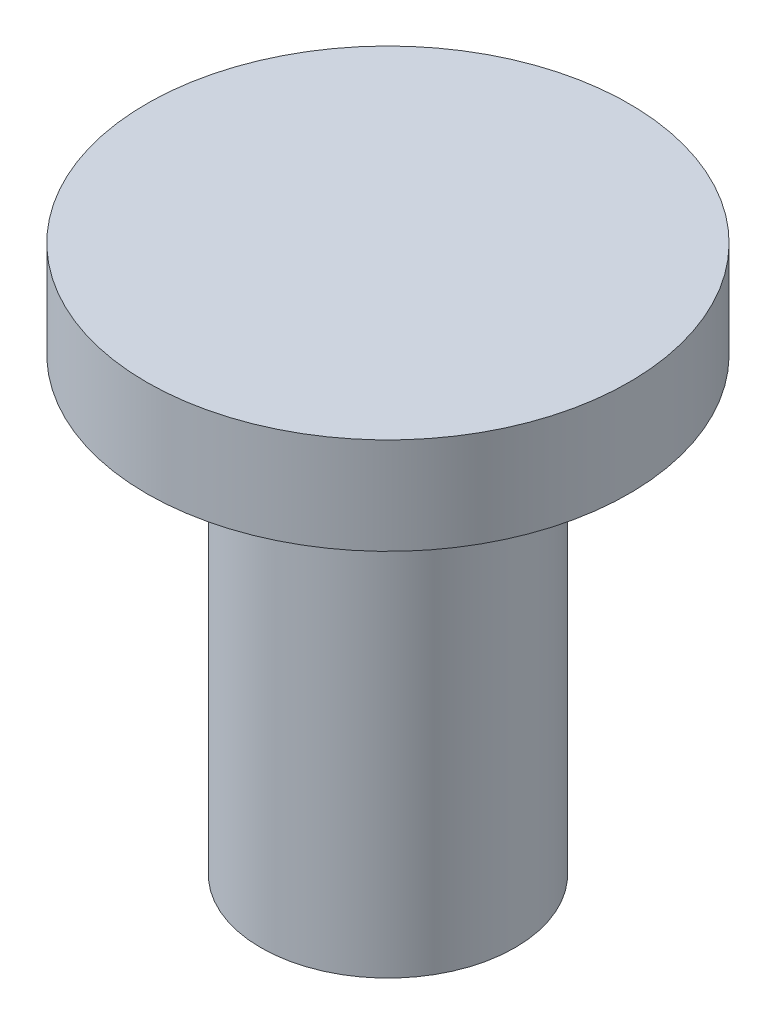
ISO-10303-21;
HEADER;
FILE_DESCRIPTION(('STEP AP214'),'2;1');
FILE_NAME('part.step','',(''),(''),'','','');
FILE_SCHEMA(('AUTOMOTIVE_DESIGN { 1 0 10303 214 1 1 1 1 }'));
ENDSEC;
DATA;
#1=APPLICATION_CONTEXT('core data for automotive mechanical design processes');
#2=APPLICATION_PROTOCOL_DEFINITION('international standard','automotive_design',2000,#1);
#3=PRODUCT_CONTEXT('',#1,'mechanical');
#4=PRODUCT('Part','Part','',(#3));
#5=PRODUCT_RELATED_PRODUCT_CATEGORY('part','',(#4));
#6=PRODUCT_DEFINITION_FORMATION('','',#4);
#7=PRODUCT_DEFINITION_CONTEXT('part definition',#1,'design');
#8=PRODUCT_DEFINITION('design','',#6,#7);
#9=PRODUCT_DEFINITION_SHAPE('','',#8);
#10=(LENGTH_UNIT() NAMED_UNIT(*) SI_UNIT(.MILLI.,.METRE.));
#11=(NAMED_UNIT(*) PLANE_ANGLE_UNIT() SI_UNIT($,.RADIAN.));
#12=(NAMED_UNIT(*) SI_UNIT($,.STERADIAN.) SOLID_ANGLE_UNIT());
#13=UNCERTAINTY_MEASURE_WITH_UNIT(LENGTH_MEASURE(1.E-05),#10,'distance_accuracy_value','');
#14=(GEOMETRIC_REPRESENTATION_CONTEXT(3) GLOBAL_UNCERTAINTY_ASSIGNED_CONTEXT((#13)) GLOBAL_UNIT_ASSIGNED_CONTEXT((#10,
#11,#12)) REPRESENTATION_CONTEXT('',''));
#15=CARTESIAN_POINT('',(0.,0.,0.));
#16=DIRECTION('',(0.,0.,1.));
#17=DIRECTION('',(1.,0.,0.));
#18=AXIS2_PLACEMENT_3D('',#15,#16,#17);
#19=CARTESIAN_POINT('',(0.,9.42265193370165,-2.0524861878453));
#20=DIRECTION('',(0.,1.,0.));
#21=DIRECTION('',(0.,0.,1.));
#22=AXIS2_PLACEMENT_3D('',#19,#20,#21);
#23=PLANE('',#22);
#24=CARTESIAN_POINT('',(0.,9.42265193370166,-2.0524861878453));
#25=DIRECTION('',(0.,1.,0.));
#26=DIRECTION('',(0.,0.,1.));
#27=AXIS2_PLACEMENT_3D('',#24,#25,#26);
#28=CIRCLE('',#27,7.5);
#29=CARTESIAN_POINT('',(0.,9.42265193370165,5.4475138121547));
#30=VERTEX_POINT('',#29);
#31=EDGE_CURVE('E10',#30,#30,#28,.T.);
#32=ORIENTED_EDGE('',*,*,#31,.T.);
#33=EDGE_LOOP('',(#32));
#34=FACE_BOUND('',#33,.T.);
#35=ADVANCED_FACE('F37',(#34),#23,.T.);
#36=CARTESIAN_POINT('',(0.,9.42265193370166,-2.0524861878453));
#37=DIRECTION('',(0.,1.,0.));
#38=DIRECTION('',(0.,0.,1.));
#39=AXIS2_PLACEMENT_3D('',#36,#37,#38);
#40=CYLINDRICAL_SURFACE('',#39,7.5);
#41=CARTESIAN_POINT('',(0.,6.42265193370166,-2.0524861878453));
#42=DIRECTION('',(0.,1.,0.));
#43=DIRECTION('',(0.,0.,1.));
#44=AXIS2_PLACEMENT_3D('',#41,#42,#43);
#45=CIRCLE('',#44,7.5);
#46=CARTESIAN_POINT('',(0.,6.42265193370165,5.4475138121547));
#47=VERTEX_POINT('',#46);
#48=EDGE_CURVE('E44',#47,#47,#45,.T.);
#49=ORIENTED_EDGE('',*,*,#48,.T.);
#50=EDGE_LOOP('',(#49));
#51=FACE_BOUND('',#50,.T.);
#52=ORIENTED_EDGE('',*,*,#31,.F.);
#53=EDGE_LOOP('',(#52));
#54=FACE_BOUND('',#53,.T.);
#55=ADVANCED_FACE('F73',(#51,#54),#40,.T.);
#56=CARTESIAN_POINT('',(0.,6.42265193370165,5.4475138121547));
#57=DIRECTION('',(0.,-1.,0.));
#58=DIRECTION('',(0.,0.,-1.));
#59=AXIS2_PLACEMENT_3D('',#56,#57,#58);
#60=PLANE('',#59);
#61=CARTESIAN_POINT('',(0.,6.42265193370166,-2.0524861878453));
#62=DIRECTION('',(0.,1.,0.));
#63=DIRECTION('',(0.,0.,1.));
#64=AXIS2_PLACEMENT_3D('',#61,#62,#63);
#65=CIRCLE('',#64,3.95);
#66=CARTESIAN_POINT('',(0.,6.42265193370165,1.8975138121547));
#67=VERTEX_POINT('',#66);
#68=EDGE_CURVE('E49',#67,#67,#65,.T.);
#69=ORIENTED_EDGE('',*,*,#68,.T.);
#70=EDGE_LOOP('',(#69));
#71=FACE_BOUND('',#70,.T.);
#72=ORIENTED_EDGE('',*,*,#48,.F.);
#73=EDGE_LOOP('',(#72));
#74=FACE_BOUND('',#73,.T.);
#75=ADVANCED_FACE('F70',(#71,#74),#60,.T.);
#76=CARTESIAN_POINT('',(0.,9.42265193370166,-2.0524861878453));
#77=DIRECTION('',(0.,1.,0.));
#78=DIRECTION('',(0.,0.,1.));
#79=AXIS2_PLACEMENT_3D('',#76,#77,#78);
#80=CYLINDRICAL_SURFACE('',#79,3.95);
#81=CARTESIAN_POINT('',(0.,-7.57734806629834,-2.05248618784531));
#82=DIRECTION('',(0.,1.,0.));
#83=DIRECTION('',(0.,0.,1.));
#84=AXIS2_PLACEMENT_3D('',#81,#82,#83);
#85=CIRCLE('',#84,3.95);
#86=CARTESIAN_POINT('',(0.,-7.57734806629835,1.8975138121547));
#87=VERTEX_POINT('',#86);
#88=EDGE_CURVE('E54',#87,#87,#85,.T.);
#89=ORIENTED_EDGE('',*,*,#88,.T.);
#90=EDGE_LOOP('',(#89));
#91=FACE_BOUND('',#90,.T.);
#92=ORIENTED_EDGE('',*,*,#68,.F.);
#93=EDGE_LOOP('',(#92));
#94=FACE_BOUND('',#93,.T.);
#95=ADVANCED_FACE('F61',(#91,#94),#80,.T.);
#96=CARTESIAN_POINT('',(0.,-7.57734806629835,1.8975138121547));
#97=DIRECTION('',(0.,-1.,0.));
#98=DIRECTION('',(0.,0.,-1.));
#99=AXIS2_PLACEMENT_3D('',#96,#97,#98);
#100=PLANE('',#99);
#101=ORIENTED_EDGE('',*,*,#88,.F.);
#102=EDGE_LOOP('',(#101));
#103=FACE_BOUND('',#102,.T.);
#104=ADVANCED_FACE('F64',(#103),#100,.T.);
#105=CLOSED_SHELL('',(#35,#55,#75,#95,#104));
#106=MANIFOLD_SOLID_BREP('B2',#105);
#107=ADVANCED_BREP_SHAPE_REPRESENTATION('',(#18,#106),#14);
#108=SHAPE_DEFINITION_REPRESENTATION(#9,#107);
ENDSEC;
END-ISO-10303-21;
